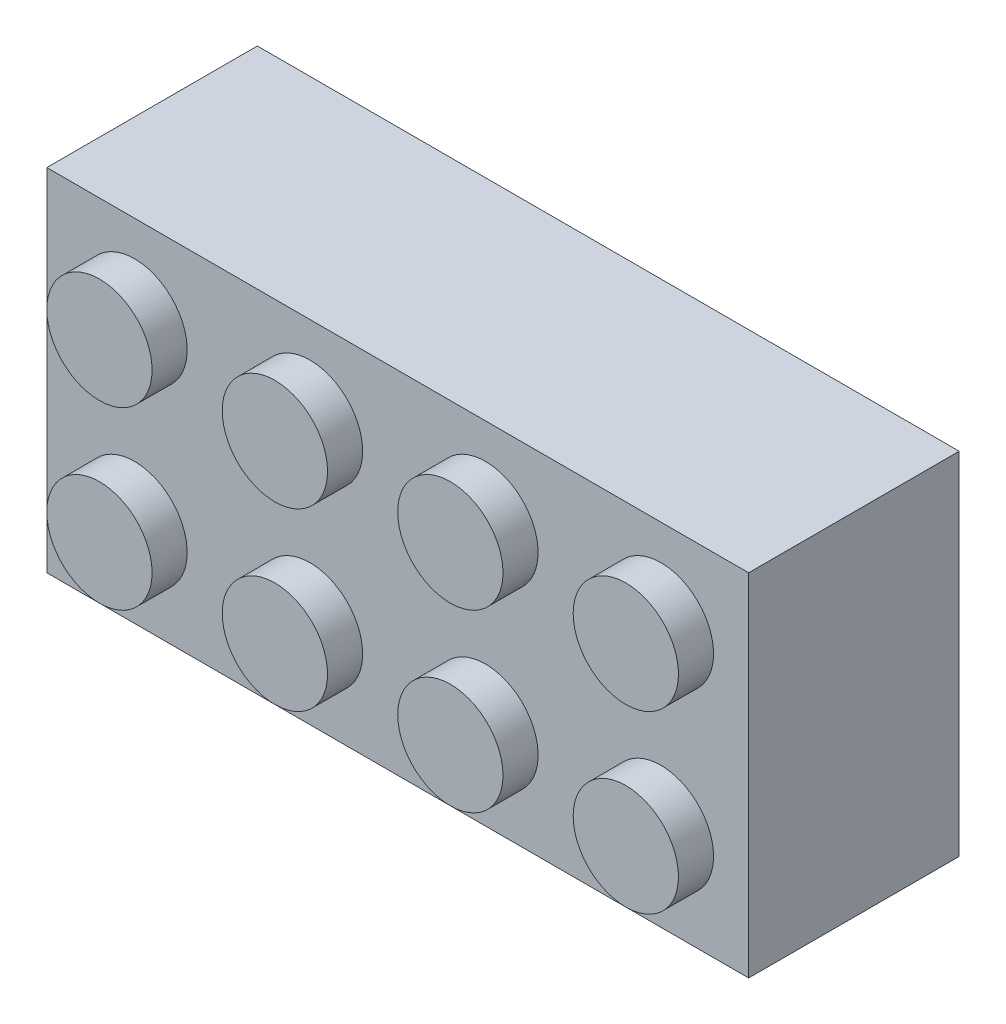
ISO-10303-21;
HEADER;
FILE_DESCRIPTION(('STEP AP214'),'2;1');
FILE_NAME('part.step','',(''),(''),'','','');
FILE_SCHEMA(('AUTOMOTIVE_DESIGN { 1 0 10303 214 1 1 1 1 }'));
ENDSEC;
DATA;
#1=APPLICATION_CONTEXT('core data for automotive mechanical design processes');
#2=APPLICATION_PROTOCOL_DEFINITION('international standard','automotive_design',2000,#1);
#3=PRODUCT_CONTEXT('',#1,'mechanical');
#4=PRODUCT('Part','Part','',(#3));
#5=PRODUCT_RELATED_PRODUCT_CATEGORY('part','',(#4));
#6=PRODUCT_DEFINITION_FORMATION('','',#4);
#7=PRODUCT_DEFINITION_CONTEXT('part definition',#1,'design');
#8=PRODUCT_DEFINITION('design','',#6,#7);
#9=PRODUCT_DEFINITION_SHAPE('','',#8);
#10=(LENGTH_UNIT() NAMED_UNIT(*) SI_UNIT(.MILLI.,.METRE.));
#11=(NAMED_UNIT(*) PLANE_ANGLE_UNIT() SI_UNIT($,.RADIAN.));
#12=(NAMED_UNIT(*) SI_UNIT($,.STERADIAN.) SOLID_ANGLE_UNIT());
#13=UNCERTAINTY_MEASURE_WITH_UNIT(LENGTH_MEASURE(1.E-05),#10,'distance_accuracy_value','');
#14=(GEOMETRIC_REPRESENTATION_CONTEXT(3) GLOBAL_UNCERTAINTY_ASSIGNED_CONTEXT((#13)) GLOBAL_UNIT_ASSIGNED_CONTEXT((#10,
#11,#12)) REPRESENTATION_CONTEXT('',''));
#15=CARTESIAN_POINT('',(0.,0.,0.));
#16=DIRECTION('',(0.,0.,1.));
#17=DIRECTION('',(1.,0.,0.));
#18=AXIS2_PLACEMENT_3D('',#15,#16,#17);
#19=CARTESIAN_POINT('',(23.8125,7.9375,0.));
#20=DIRECTION('',(0.,0.,1.));
#21=DIRECTION('',(1.,0.,0.));
#22=AXIS2_PLACEMENT_3D('',#19,#20,#21);
#23=CYLINDRICAL_SURFACE('',#22,3.175);
#24=CARTESIAN_POINT('',(23.8125,7.9375,0.));
#25=DIRECTION('',(0.,0.,-1.));
#26=DIRECTION('',(-1.,0.,0.));
#27=AXIS2_PLACEMENT_3D('',#24,#25,#26);
#28=CIRCLE('',#27,3.175);
#29=CARTESIAN_POINT('',(20.6375,7.9375,0.));
#30=VERTEX_POINT('',#29);
#31=EDGE_CURVE('E11',#30,#30,#28,.T.);
#32=ORIENTED_EDGE('',*,*,#31,.F.);
#33=EDGE_LOOP('',(#32));
#34=FACE_BOUND('',#33,.T.);
#35=CARTESIAN_POINT('',(23.8125,7.9375,7.9375));
#36=DIRECTION('',(0.,0.,-1.));
#37=DIRECTION('',(-1.,0.,0.));
#38=AXIS2_PLACEMENT_3D('',#35,#36,#37);
#39=CIRCLE('',#38,3.175);
#40=CARTESIAN_POINT('',(20.6375,7.9375,7.9375));
#41=VERTEX_POINT('',#40);
#42=EDGE_CURVE('E43',#41,#41,#39,.T.);
#43=ORIENTED_EDGE('',*,*,#42,.T.);
#44=EDGE_LOOP('',(#43));
#45=FACE_BOUND('',#44,.T.);
#46=ADVANCED_FACE('F40',(#34,#45),#23,.T.);
#47=CARTESIAN_POINT('',(23.8125,7.9375,0.));
#48=DIRECTION('',(0.,0.,-1.));
#49=DIRECTION('',(-1.,0.,0.));
#50=AXIS2_PLACEMENT_3D('',#47,#48,#49);
#51=PLANE('',#50);
#52=CARTESIAN_POINT('',(23.8125,7.9375,0.));
#53=DIRECTION('',(0.,0.,-1.));
#54=DIRECTION('',(-1.,0.,0.));
#55=AXIS2_PLACEMENT_3D('',#52,#53,#54);
#56=CIRCLE('',#55,2.38125);
#57=CARTESIAN_POINT('',(21.43125,7.9375,0.));
#58=VERTEX_POINT('',#57);
#59=EDGE_CURVE('E50',#58,#58,#56,.T.);
#60=ORIENTED_EDGE('',*,*,#59,.F.);
#61=EDGE_LOOP('',(#60));
#62=FACE_BOUND('',#61,.T.);
#63=ORIENTED_EDGE('',*,*,#31,.T.);
#64=EDGE_LOOP('',(#63));
#65=FACE_BOUND('',#64,.T.);
#66=ADVANCED_FACE('F70',(#62,#65),#51,.T.);
#67=CARTESIAN_POINT('',(23.8125,7.9375,7.9375));
#68=DIRECTION('',(0.,0.,-1.));
#69=DIRECTION('',(-1.,0.,0.));
#70=AXIS2_PLACEMENT_3D('',#67,#68,#69);
#71=PLANE('',#70);
#72=ORIENTED_EDGE('',*,*,#42,.F.);
#73=EDGE_LOOP('',(#72));
#74=FACE_BOUND('',#73,.T.);
#75=ADVANCED_FACE('F62',(#74),#71,.F.);
#76=CARTESIAN_POINT('',(23.8125,7.9375,0.));
#77=DIRECTION('',(0.,0.,1.));
#78=DIRECTION('',(1.,0.,0.));
#79=AXIS2_PLACEMENT_3D('',#76,#77,#78);
#80=CYLINDRICAL_SURFACE('',#79,2.38125);
#81=ORIENTED_EDGE('',*,*,#59,.T.);
#82=EDGE_LOOP('',(#81));
#83=FACE_BOUND('',#82,.T.);
#84=CARTESIAN_POINT('',(23.8125,7.9375,7.14375));
#85=DIRECTION('',(0.,0.,-1.));
#86=DIRECTION('',(-1.,0.,0.));
#87=AXIS2_PLACEMENT_3D('',#84,#85,#86);
#88=CIRCLE('',#87,2.38125);
#89=CARTESIAN_POINT('',(21.43125,7.9375,7.14375));
#90=VERTEX_POINT('',#89);
#91=EDGE_CURVE('E54',#90,#90,#88,.T.);
#92=ORIENTED_EDGE('',*,*,#91,.F.);
#93=EDGE_LOOP('',(#92));
#94=FACE_BOUND('',#93,.T.);
#95=ADVANCED_FACE('F60',(#83,#94),#80,.F.);
#96=CARTESIAN_POINT('',(23.8125,7.9375,7.14375));
#97=DIRECTION('',(0.,0.,-1.));
#98=DIRECTION('',(-1.,0.,0.));
#99=AXIS2_PLACEMENT_3D('',#96,#97,#98);
#100=PLANE('',#99);
#101=ORIENTED_EDGE('',*,*,#91,.T.);
#102=EDGE_LOOP('',(#101));
#103=FACE_BOUND('',#102,.T.);
#104=ADVANCED_FACE('F58',(#103),#100,.T.);
#105=CLOSED_SHELL('',(#46,#66,#75,#95,#104));
#106=MANIFOLD_SOLID_BREP('B2',#105);
#107=CARTESIAN_POINT('',(0.,0.,7.9375));
#108=DIRECTION('',(0.,0.,-1.));
#109=DIRECTION('',(-1.,0.,0.));
#110=AXIS2_PLACEMENT_3D('',#107,#108,#109);
#111=PLANE('',#110);
#112=CARTESIAN_POINT('',(15.875,7.9375,7.9375));
#113=DIRECTION('',(0.,0.,-1.));
#114=DIRECTION('',(-1.,0.,0.));
#115=AXIS2_PLACEMENT_3D('',#112,#113,#114);
#116=CIRCLE('',#115,3.175);
#117=CARTESIAN_POINT('',(12.7,7.9375,7.9375));
#118=VERTEX_POINT('',#117);
#119=EDGE_CURVE('E826',#118,#118,#116,.T.);
#120=ORIENTED_EDGE('',*,*,#119,.F.);
#121=EDGE_LOOP('',(#120));
#122=FACE_BOUND('',#121,.T.);
#123=CARTESIAN_POINT('',(3.96875,11.90625,7.9375));
#124=DIRECTION('',(0.,0.,-1.));
#125=DIRECTION('',(-1.,0.,0.));
#126=AXIS2_PLACEMENT_3D('',#123,#124,#125);
#127=CIRCLE('',#126,0.79375);
#128=CARTESIAN_POINT('',(3.175,11.90625,7.9375));
#129=VERTEX_POINT('',#128);
#130=EDGE_CURVE('E214',#129,#129,#127,.F.);
#131=ORIENTED_EDGE('',*,*,#130,.T.);
#132=EDGE_LOOP('',(#131));
#133=FACE_BOUND('',#132,.T.);
#134=DIRECTION('',(0.,-1.,0.));
#135=VECTOR('',#134,1.);
#136=CARTESIAN_POINT('',(1.5875,0.,7.9375));
#137=LINE('',#136,#135);
#138=CARTESIAN_POINT('',(1.5875,14.2875,7.9375));
#139=VERTEX_POINT('',#138);
#140=CARTESIAN_POINT('',(1.5875,1.5875,7.9375));
#141=VERTEX_POINT('',#140);
#142=EDGE_CURVE('E196',#139,#141,#137,.T.);
#143=ORIENTED_EDGE('',*,*,#142,.F.);
#144=DIRECTION('',(-1.,0.,0.));
#145=VECTOR('',#144,1.);
#146=CARTESIAN_POINT('',(0.,14.2875,7.9375));
#147=LINE('',#146,#145);
#148=CARTESIAN_POINT('',(30.1625,14.2875,7.9375));
#149=VERTEX_POINT('',#148);
#150=EDGE_CURVE('E204',#149,#139,#147,.T.);
#151=ORIENTED_EDGE('',*,*,#150,.F.);
#152=DIRECTION('',(0.,1.,0.));
#153=VECTOR('',#152,1.);
#154=CARTESIAN_POINT('',(30.1625,0.,7.9375));
#155=LINE('',#154,#153);
#156=CARTESIAN_POINT('',(30.1625,1.5875,7.9375));
#157=VERTEX_POINT('',#156);
#158=EDGE_CURVE('E195',#157,#149,#155,.T.);
#159=ORIENTED_EDGE('',*,*,#158,.F.);
#160=DIRECTION('',(1.,0.,0.));
#161=VECTOR('',#160,1.);
#162=CARTESIAN_POINT('',(0.,1.5875,7.9375));
#163=LINE('',#162,#161);
#164=EDGE_CURVE('E185',#141,#157,#163,.T.);
#165=ORIENTED_EDGE('',*,*,#164,.F.);
#166=EDGE_LOOP('',(#143,#151,#159,#165));
#167=FACE_BOUND('',#166,.T.);
#168=CARTESIAN_POINT('',(3.96875,3.96875,7.9375));
#169=DIRECTION('',(0.,0.,-1.));
#170=DIRECTION('',(-1.,0.,0.));
#171=AXIS2_PLACEMENT_3D('',#168,#169,#170);
#172=CIRCLE('',#171,0.79375);
#173=CARTESIAN_POINT('',(3.175,3.96875,7.9375));
#174=VERTEX_POINT('',#173);
#175=EDGE_CURVE('E210',#174,#174,#172,.F.);
#176=ORIENTED_EDGE('',*,*,#175,.T.);
#177=EDGE_LOOP('',(#176));
#178=FACE_BOUND('',#177,.T.);
#179=CARTESIAN_POINT('',(11.90625,11.90625,7.9375));
#180=DIRECTION('',(0.,0.,-1.));
#181=DIRECTION('',(-1.,0.,0.));
#182=AXIS2_PLACEMENT_3D('',#179,#180,#181);
#183=CIRCLE('',#182,0.79375);
#184=CARTESIAN_POINT('',(11.1125,11.90625,7.9375));
#185=VERTEX_POINT('',#184);
#186=EDGE_CURVE('E213',#185,#185,#183,.F.);
#187=ORIENTED_EDGE('',*,*,#186,.T.);
#188=EDGE_LOOP('',(#187));
#189=FACE_BOUND('',#188,.T.);
#190=CARTESIAN_POINT('',(11.90625,3.96875,7.9375));
#191=DIRECTION('',(0.,0.,-1.));
#192=DIRECTION('',(-1.,0.,0.));
#193=AXIS2_PLACEMENT_3D('',#190,#191,#192);
#194=CIRCLE('',#193,0.79375);
#195=CARTESIAN_POINT('',(11.1125,3.96875,7.9375));
#196=VERTEX_POINT('',#195);
#197=EDGE_CURVE('E218',#196,#196,#194,.F.);
#198=ORIENTED_EDGE('',*,*,#197,.T.);
#199=EDGE_LOOP('',(#198));
#200=FACE_BOUND('',#199,.T.);
#201=CARTESIAN_POINT('',(19.84375,11.90625,7.9375));
#202=DIRECTION('',(0.,0.,-1.));
#203=DIRECTION('',(-1.,0.,0.));
#204=AXIS2_PLACEMENT_3D('',#201,#202,#203);
#205=CIRCLE('',#204,0.79375);
#206=CARTESIAN_POINT('',(19.05,11.90625,7.9375));
#207=VERTEX_POINT('',#206);
#208=EDGE_CURVE('E222',#207,#207,#205,.F.);
#209=ORIENTED_EDGE('',*,*,#208,.T.);
#210=EDGE_LOOP('',(#209));
#211=FACE_BOUND('',#210,.T.);
#212=CARTESIAN_POINT('',(19.84375,3.96875,7.9375));
#213=DIRECTION('',(0.,0.,-1.));
#214=DIRECTION('',(-1.,0.,0.));
#215=AXIS2_PLACEMENT_3D('',#212,#213,#214);
#216=CIRCLE('',#215,0.79375);
#217=CARTESIAN_POINT('',(19.05,3.96875,7.9375));
#218=VERTEX_POINT('',#217);
#219=EDGE_CURVE('E226',#218,#218,#216,.F.);
#220=ORIENTED_EDGE('',*,*,#219,.T.);
#221=EDGE_LOOP('',(#220));
#222=FACE_BOUND('',#221,.T.);
#223=CARTESIAN_POINT('',(27.78125,11.90625,7.9375));
#224=DIRECTION('',(0.,0.,-1.));
#225=DIRECTION('',(-1.,0.,0.));
#226=AXIS2_PLACEMENT_3D('',#223,#224,#225);
#227=CIRCLE('',#226,0.79375);
#228=CARTESIAN_POINT('',(26.9875,11.90625,7.9375));
#229=VERTEX_POINT('',#228);
#230=EDGE_CURVE('E230',#229,#229,#227,.F.);
#231=ORIENTED_EDGE('',*,*,#230,.T.);
#232=EDGE_LOOP('',(#231));
#233=FACE_BOUND('',#232,.T.);
#234=CARTESIAN_POINT('',(27.78125,3.96875,7.9375));
#235=DIRECTION('',(0.,0.,-1.));
#236=DIRECTION('',(-1.,0.,0.));
#237=AXIS2_PLACEMENT_3D('',#234,#235,#236);
#238=CIRCLE('',#237,0.79375);
#239=CARTESIAN_POINT('',(26.9875,3.96875,7.9375));
#240=VERTEX_POINT('',#239);
#241=EDGE_CURVE('E234',#240,#240,#238,.F.);
#242=ORIENTED_EDGE('',*,*,#241,.T.);
#243=EDGE_LOOP('',(#242));
#244=FACE_BOUND('',#243,.T.);
#245=CARTESIAN_POINT('',(7.9375,7.9375,7.9375));
#246=DIRECTION('',(0.,0.,-1.));
#247=DIRECTION('',(-1.,0.,0.));
#248=AXIS2_PLACEMENT_3D('',#245,#246,#247);
#249=CIRCLE('',#248,3.175);
#250=CARTESIAN_POINT('',(4.7625,7.9375,7.9375));
#251=VERTEX_POINT('',#250);
#252=EDGE_CURVE('E829',#251,#251,#249,.T.);
#253=ORIENTED_EDGE('',*,*,#252,.F.);
#254=EDGE_LOOP('',(#253));
#255=FACE_BOUND('',#254,.T.);
#256=ADVANCED_FACE('F110',(#122,#133,#167,#178,#189,#200,#211,#222,#233,#244,#255),#111,.T.);
#257=CARTESIAN_POINT('',(0.,0.,0.));
#258=DIRECTION('',(0.,0.,-1.));
#259=DIRECTION('',(-1.,0.,0.));
#260=AXIS2_PLACEMENT_3D('',#257,#258,#259);
#261=PLANE('',#260);
#262=DIRECTION('',(0.,-1.,0.));
#263=VECTOR('',#262,1.);
#264=CARTESIAN_POINT('',(0.,0.,0.));
#265=LINE('',#264,#263);
#266=CARTESIAN_POINT('',(0.,15.875,0.));
#267=VERTEX_POINT('',#266);
#268=CARTESIAN_POINT('',(0.,0.,0.));
#269=VERTEX_POINT('',#268);
#270=EDGE_CURVE('E275',#267,#269,#265,.T.);
#271=ORIENTED_EDGE('',*,*,#270,.F.);
#272=DIRECTION('',(-1.,0.,0.));
#273=VECTOR('',#272,1.);
#274=CARTESIAN_POINT('',(0.,15.875,0.));
#275=LINE('',#274,#273);
#276=CARTESIAN_POINT('',(31.75,15.875,0.));
#277=VERTEX_POINT('',#276);
#278=EDGE_CURVE('E155',#277,#267,#275,.T.);
#279=ORIENTED_EDGE('',*,*,#278,.F.);
#280=DIRECTION('',(0.,1.,0.));
#281=VECTOR('',#280,1.);
#282=CARTESIAN_POINT('',(31.75,0.,0.));
#283=LINE('',#282,#281);
#284=CARTESIAN_POINT('',(31.75,0.,0.));
#285=VERTEX_POINT('',#284);
#286=EDGE_CURVE('E287',#285,#277,#283,.T.);
#287=ORIENTED_EDGE('',*,*,#286,.F.);
#288=DIRECTION('',(1.,0.,0.));
#289=VECTOR('',#288,1.);
#290=CARTESIAN_POINT('',(0.,0.,0.));
#291=LINE('',#290,#289);
#292=EDGE_CURVE('E285',#269,#285,#291,.T.);
#293=ORIENTED_EDGE('',*,*,#292,.F.);
#294=EDGE_LOOP('',(#271,#279,#287,#293));
#295=FACE_BOUND('',#294,.T.);
#296=DIRECTION('',(-1.,0.,0.));
#297=VECTOR('',#296,1.);
#298=CARTESIAN_POINT('',(0.,14.2875,0.));
#299=LINE('',#298,#297);
#300=CARTESIAN_POINT('',(30.1625,14.2875,0.));
#301=VERTEX_POINT('',#300);
#302=CARTESIAN_POINT('',(1.5875,14.2875,0.));
#303=VERTEX_POINT('',#302);
#304=EDGE_CURVE('E265',#301,#303,#299,.T.);
#305=ORIENTED_EDGE('',*,*,#304,.T.);
#306=DIRECTION('',(0.,-1.,0.));
#307=VECTOR('',#306,1.);
#308=CARTESIAN_POINT('',(1.5875,0.,0.));
#309=LINE('',#308,#307);
#310=CARTESIAN_POINT('',(1.5875,1.5875,0.));
#311=VERTEX_POINT('',#310);
#312=EDGE_CURVE('E244',#303,#311,#309,.T.);
#313=ORIENTED_EDGE('',*,*,#312,.T.);
#314=DIRECTION('',(1.,0.,0.));
#315=VECTOR('',#314,1.);
#316=CARTESIAN_POINT('',(0.,1.5875,0.));
#317=LINE('',#316,#315);
#318=CARTESIAN_POINT('',(30.1625,1.5875,0.));
#319=VERTEX_POINT('',#318);
#320=EDGE_CURVE('E264',#311,#319,#317,.T.);
#321=ORIENTED_EDGE('',*,*,#320,.T.);
#322=DIRECTION('',(0.,1.,0.));
#323=VECTOR('',#322,1.);
#324=CARTESIAN_POINT('',(30.1625,0.,0.));
#325=LINE('',#324,#323);
#326=EDGE_CURVE('E125',#319,#301,#325,.T.);
#327=ORIENTED_EDGE('',*,*,#326,.T.);
#328=EDGE_LOOP('',(#305,#313,#321,#327));
#329=FACE_BOUND('',#328,.T.);
#330=ADVANCED_FACE('F341',(#295,#329),#261,.T.);
#331=CARTESIAN_POINT('',(0.,0.,9.525));
#332=DIRECTION('',(0.,0.,-1.));
#333=DIRECTION('',(-1.,0.,0.));
#334=AXIS2_PLACEMENT_3D('',#331,#332,#333);
#335=PLANE('',#334);
#336=CARTESIAN_POINT('',(3.96875,11.90625,9.525));
#337=DIRECTION('',(0.,0.,-1.));
#338=DIRECTION('',(-1.,0.,0.));
#339=AXIS2_PLACEMENT_3D('',#336,#337,#338);
#340=CIRCLE('',#339,2.38125);
#341=CARTESIAN_POINT('',(1.5875,11.90625,9.525));
#342=VERTEX_POINT('',#341);
#343=EDGE_CURVE('E298',#342,#342,#340,.F.);
#344=ORIENTED_EDGE('',*,*,#343,.F.);
#345=EDGE_LOOP('',(#344));
#346=FACE_BOUND('',#345,.T.);
#347=DIRECTION('',(0.,-1.,0.));
#348=VECTOR('',#347,1.);
#349=CARTESIAN_POINT('',(0.,0.,9.525));
#350=LINE('',#349,#348);
#351=CARTESIAN_POINT('',(0.,15.875,9.525));
#352=VERTEX_POINT('',#351);
#353=CARTESIAN_POINT('',(0.,0.,9.525));
#354=VERTEX_POINT('',#353);
#355=EDGE_CURVE('E276',#352,#354,#350,.T.);
#356=ORIENTED_EDGE('',*,*,#355,.T.);
#357=DIRECTION('',(1.,0.,0.));
#358=VECTOR('',#357,1.);
#359=CARTESIAN_POINT('',(0.,0.,9.525));
#360=LINE('',#359,#358);
#361=CARTESIAN_POINT('',(31.75,0.,9.525));
#362=VERTEX_POINT('',#361);
#363=EDGE_CURVE('E163',#354,#362,#360,.T.);
#364=ORIENTED_EDGE('',*,*,#363,.T.);
#365=DIRECTION('',(0.,1.,0.));
#366=VECTOR('',#365,1.);
#367=CARTESIAN_POINT('',(31.75,0.,9.525));
#368=LINE('',#367,#366);
#369=CARTESIAN_POINT('',(31.75,15.875,9.525));
#370=VERTEX_POINT('',#369);
#371=EDGE_CURVE('E279',#362,#370,#368,.T.);
#372=ORIENTED_EDGE('',*,*,#371,.T.);
#373=DIRECTION('',(-1.,0.,0.));
#374=VECTOR('',#373,1.);
#375=CARTESIAN_POINT('',(0.,15.875,9.525));
#376=LINE('',#375,#374);
#377=EDGE_CURVE('E134',#370,#352,#376,.T.);
#378=ORIENTED_EDGE('',*,*,#377,.T.);
#379=EDGE_LOOP('',(#356,#364,#372,#378));
#380=FACE_BOUND('',#379,.T.);
#381=CARTESIAN_POINT('',(3.96875,3.96875,9.525));
#382=DIRECTION('',(0.,0.,-1.));
#383=DIRECTION('',(-1.,0.,0.));
#384=AXIS2_PLACEMENT_3D('',#381,#382,#383);
#385=CIRCLE('',#384,2.38125);
#386=CARTESIAN_POINT('',(1.5875,3.96875,9.525));
#387=VERTEX_POINT('',#386);
#388=EDGE_CURVE('E301',#387,#387,#385,.F.);
#389=ORIENTED_EDGE('',*,*,#388,.F.);
#390=EDGE_LOOP('',(#389));
#391=FACE_BOUND('',#390,.T.);
#392=CARTESIAN_POINT('',(11.90625,11.90625,9.525));
#393=DIRECTION('',(0.,0.,-1.));
#394=DIRECTION('',(-1.,0.,0.));
#395=AXIS2_PLACEMENT_3D('',#392,#393,#394);
#396=CIRCLE('',#395,2.38125);
#397=CARTESIAN_POINT('',(9.525,11.90625,9.525));
#398=VERTEX_POINT('',#397);
#399=EDGE_CURVE('E304',#398,#398,#396,.F.);
#400=ORIENTED_EDGE('',*,*,#399,.F.);
#401=EDGE_LOOP('',(#400));
#402=FACE_BOUND('',#401,.T.);
#403=CARTESIAN_POINT('',(11.90625,3.96875,9.525));
#404=DIRECTION('',(0.,0.,-1.));
#405=DIRECTION('',(-1.,0.,0.));
#406=AXIS2_PLACEMENT_3D('',#403,#404,#405);
#407=CIRCLE('',#406,2.38125);
#408=CARTESIAN_POINT('',(9.525,3.96875,9.525));
#409=VERTEX_POINT('',#408);
#410=EDGE_CURVE('E310',#409,#409,#407,.F.);
#411=ORIENTED_EDGE('',*,*,#410,.F.);
#412=EDGE_LOOP('',(#411));
#413=FACE_BOUND('',#412,.T.);
#414=CARTESIAN_POINT('',(19.84375,11.90625,9.525));
#415=DIRECTION('',(0.,0.,-1.));
#416=DIRECTION('',(-1.,0.,0.));
#417=AXIS2_PLACEMENT_3D('',#414,#415,#416);
#418=CIRCLE('',#417,2.38125);
#419=CARTESIAN_POINT('',(17.4625,11.90625,9.525));
#420=VERTEX_POINT('',#419);
#421=EDGE_CURVE('E316',#420,#420,#418,.F.);
#422=ORIENTED_EDGE('',*,*,#421,.F.);
#423=EDGE_LOOP('',(#422));
#424=FACE_BOUND('',#423,.T.);
#425=CARTESIAN_POINT('',(19.84375,3.96875,9.525));
#426=DIRECTION('',(0.,0.,-1.));
#427=DIRECTION('',(-1.,0.,0.));
#428=AXIS2_PLACEMENT_3D('',#425,#426,#427);
#429=CIRCLE('',#428,2.38125);
#430=CARTESIAN_POINT('',(17.4625,3.96875,9.525));
#431=VERTEX_POINT('',#430);
#432=EDGE_CURVE('E322',#431,#431,#429,.F.);
#433=ORIENTED_EDGE('',*,*,#432,.F.);
#434=EDGE_LOOP('',(#433));
#435=FACE_BOUND('',#434,.T.);
#436=CARTESIAN_POINT('',(27.78125,11.90625,9.525));
#437=DIRECTION('',(0.,0.,-1.));
#438=DIRECTION('',(-1.,0.,0.));
#439=AXIS2_PLACEMENT_3D('',#436,#437,#438);
#440=CIRCLE('',#439,2.38125);
#441=CARTESIAN_POINT('',(25.4,11.90625,9.525));
#442=VERTEX_POINT('',#441);
#443=EDGE_CURVE('E328',#442,#442,#440,.F.);
#444=ORIENTED_EDGE('',*,*,#443,.F.);
#445=EDGE_LOOP('',(#444));
#446=FACE_BOUND('',#445,.T.);
#447=CARTESIAN_POINT('',(27.78125,3.96875,9.525));
#448=DIRECTION('',(0.,0.,-1.));
#449=DIRECTION('',(-1.,0.,0.));
#450=AXIS2_PLACEMENT_3D('',#447,#448,#449);
#451=CIRCLE('',#450,2.38125);
#452=CARTESIAN_POINT('',(25.4,3.96875,9.525));
#453=VERTEX_POINT('',#452);
#454=EDGE_CURVE('E118',#453,#453,#451,.F.);
#455=ORIENTED_EDGE('',*,*,#454,.F.);
#456=EDGE_LOOP('',(#455));
#457=FACE_BOUND('',#456,.T.);
#458=ADVANCED_FACE('F338',(#346,#380,#391,#402,#413,#424,#435,#446,#457),#335,.F.);
#459=CARTESIAN_POINT('',(0.,0.,9.525));
#460=DIRECTION('',(1.,0.,0.));
#461=DIRECTION('',(0.,0.,-1.));
#462=AXIS2_PLACEMENT_3D('',#459,#460,#461);
#463=PLANE('',#462);
#464=ORIENTED_EDGE('',*,*,#270,.T.);
#465=DIRECTION('',(0.,0.,-1.));
#466=VECTOR('',#465,1.);
#467=CARTESIAN_POINT('',(0.,0.,9.525));
#468=LINE('',#467,#466);
#469=EDGE_CURVE('E296',#354,#269,#468,.T.);
#470=ORIENTED_EDGE('',*,*,#469,.F.);
#471=ORIENTED_EDGE('',*,*,#355,.F.);
#472=DIRECTION('',(0.,0.,-1.));
#473=VECTOR('',#472,1.);
#474=CARTESIAN_POINT('',(0.,15.875,9.525));
#475=LINE('',#474,#473);
#476=EDGE_CURVE('E282',#352,#267,#475,.T.);
#477=ORIENTED_EDGE('',*,*,#476,.T.);
#478=EDGE_LOOP('',(#464,#470,#471,#477));
#479=FACE_BOUND('',#478,.T.);
#480=ADVANCED_FACE('F340',(#479),#463,.F.);
#481=CARTESIAN_POINT('',(0.,0.,9.525));
#482=DIRECTION('',(0.,1.,0.));
#483=DIRECTION('',(0.,0.,1.));
#484=AXIS2_PLACEMENT_3D('',#481,#482,#483);
#485=PLANE('',#484);
#486=ORIENTED_EDGE('',*,*,#292,.T.);
#487=DIRECTION('',(0.,0.,-1.));
#488=VECTOR('',#487,1.);
#489=CARTESIAN_POINT('',(31.75,0.,9.525));
#490=LINE('',#489,#488);
#491=EDGE_CURVE('E293',#362,#285,#490,.T.);
#492=ORIENTED_EDGE('',*,*,#491,.F.);
#493=ORIENTED_EDGE('',*,*,#363,.F.);
#494=ORIENTED_EDGE('',*,*,#469,.T.);
#495=EDGE_LOOP('',(#486,#492,#493,#494));
#496=FACE_BOUND('',#495,.T.);
#497=ADVANCED_FACE('F348',(#496),#485,.F.);
#498=CARTESIAN_POINT('',(31.75,0.,9.525));
#499=DIRECTION('',(-1.,0.,0.));
#500=DIRECTION('',(0.,0.,1.));
#501=AXIS2_PLACEMENT_3D('',#498,#499,#500);
#502=PLANE('',#501);
#503=ORIENTED_EDGE('',*,*,#286,.T.);
#504=DIRECTION('',(0.,0.,-1.));
#505=VECTOR('',#504,1.);
#506=CARTESIAN_POINT('',(31.75,15.875,9.525));
#507=LINE('',#506,#505);
#508=EDGE_CURVE('E291',#370,#277,#507,.T.);
#509=ORIENTED_EDGE('',*,*,#508,.F.);
#510=ORIENTED_EDGE('',*,*,#371,.F.);
#511=ORIENTED_EDGE('',*,*,#491,.T.);
#512=EDGE_LOOP('',(#503,#509,#510,#511));
#513=FACE_BOUND('',#512,.T.);
#514=ADVANCED_FACE('F462',(#513),#502,.F.);
#515=CARTESIAN_POINT('',(0.,15.875,9.525));
#516=DIRECTION('',(0.,-1.,0.));
#517=DIRECTION('',(0.,0.,-1.));
#518=AXIS2_PLACEMENT_3D('',#515,#516,#517);
#519=PLANE('',#518);
#520=ORIENTED_EDGE('',*,*,#278,.T.);
#521=ORIENTED_EDGE('',*,*,#476,.F.);
#522=ORIENTED_EDGE('',*,*,#377,.F.);
#523=ORIENTED_EDGE('',*,*,#508,.T.);
#524=EDGE_LOOP('',(#520,#521,#522,#523));
#525=FACE_BOUND('',#524,.T.);
#526=ADVANCED_FACE('F457',(#525),#519,.F.);
#527=CARTESIAN_POINT('',(3.96875,11.90625,11.1125));
#528=DIRECTION('',(0.,0.,-1.));
#529=DIRECTION('',(-1.,0.,0.));
#530=AXIS2_PLACEMENT_3D('',#527,#528,#529);
#531=CYLINDRICAL_SURFACE('',#530,2.38125);
#532=CARTESIAN_POINT('',(3.96875,11.90625,11.1125));
#533=DIRECTION('',(0.,0.,1.));
#534=DIRECTION('',(1.,0.,0.));
#535=AXIS2_PLACEMENT_3D('',#532,#533,#534);
#536=CIRCLE('',#535,2.38125);
#537=CARTESIAN_POINT('',(6.35,11.90625,11.1125));
#538=VERTEX_POINT('',#537);
#539=EDGE_CURVE('E272',#538,#538,#536,.T.);
#540=ORIENTED_EDGE('',*,*,#539,.F.);
#541=EDGE_LOOP('',(#540));
#542=FACE_BOUND('',#541,.T.);
#543=ORIENTED_EDGE('',*,*,#343,.T.);
#544=EDGE_LOOP('',(#543));
#545=FACE_BOUND('',#544,.T.);
#546=ADVANCED_FACE('F454',(#542,#545),#531,.T.);
#547=CARTESIAN_POINT('',(3.96875,11.90625,11.1125));
#548=DIRECTION('',(0.,0.,1.));
#549=DIRECTION('',(1.,0.,0.));
#550=AXIS2_PLACEMENT_3D('',#547,#548,#549);
#551=PLANE('',#550);
#552=ORIENTED_EDGE('',*,*,#539,.T.);
#553=EDGE_LOOP('',(#552));
#554=FACE_BOUND('',#553,.T.);
#555=ADVANCED_FACE('F451',(#554),#551,.T.);
#556=CARTESIAN_POINT('',(3.96875,3.96875,11.1125));
#557=DIRECTION('',(0.,0.,-1.));
#558=DIRECTION('',(-1.,0.,0.));
#559=AXIS2_PLACEMENT_3D('',#556,#557,#558);
#560=CYLINDRICAL_SURFACE('',#559,2.38125);
#561=CARTESIAN_POINT('',(3.96875,3.96875,11.1125));
#562=DIRECTION('',(0.,0.,1.));
#563=DIRECTION('',(1.,0.,0.));
#564=AXIS2_PLACEMENT_3D('',#561,#562,#563);
#565=CIRCLE('',#564,2.38125);
#566=CARTESIAN_POINT('',(6.35,3.96875,11.1125));
#567=VERTEX_POINT('',#566);
#568=EDGE_CURVE('E261',#567,#567,#565,.T.);
#569=ORIENTED_EDGE('',*,*,#568,.F.);
#570=EDGE_LOOP('',(#569));
#571=FACE_BOUND('',#570,.T.);
#572=ORIENTED_EDGE('',*,*,#388,.T.);
#573=EDGE_LOOP('',(#572));
#574=FACE_BOUND('',#573,.T.);
#575=ADVANCED_FACE('F447',(#571,#574),#560,.T.);
#576=CARTESIAN_POINT('',(3.96875,3.96875,11.1125));
#577=DIRECTION('',(0.,0.,1.));
#578=DIRECTION('',(1.,0.,0.));
#579=AXIS2_PLACEMENT_3D('',#576,#577,#578);
#580=PLANE('',#579);
#581=ORIENTED_EDGE('',*,*,#568,.T.);
#582=EDGE_LOOP('',(#581));
#583=FACE_BOUND('',#582,.T.);
#584=ADVANCED_FACE('F443',(#583),#580,.T.);
#585=CARTESIAN_POINT('',(11.90625,11.90625,11.1125));
#586=DIRECTION('',(0.,0.,1.));
#587=DIRECTION('',(1.,0.,0.));
#588=AXIS2_PLACEMENT_3D('',#585,#586,#587);
#589=PLANE('',#588);
#590=CARTESIAN_POINT('',(11.90625,11.90625,11.1125));
#591=DIRECTION('',(0.,0.,1.));
#592=DIRECTION('',(1.,0.,0.));
#593=AXIS2_PLACEMENT_3D('',#590,#591,#592);
#594=CIRCLE('',#593,2.38125);
#595=CARTESIAN_POINT('',(14.2875,11.90625,11.1125));
#596=VERTEX_POINT('',#595);
#597=EDGE_CURVE('E307',#596,#596,#594,.T.);
#598=ORIENTED_EDGE('',*,*,#597,.T.);
#599=EDGE_LOOP('',(#598));
#600=FACE_BOUND('',#599,.T.);
#601=ADVANCED_FACE('F446',(#600),#589,.T.);
#602=CARTESIAN_POINT('',(11.90625,11.90625,11.1125));
#603=DIRECTION('',(0.,0.,-1.));
#604=DIRECTION('',(-1.,0.,0.));
#605=AXIS2_PLACEMENT_3D('',#602,#603,#604);
#606=CYLINDRICAL_SURFACE('',#605,2.38125);
#607=ORIENTED_EDGE('',*,*,#597,.F.);
#608=EDGE_LOOP('',(#607));
#609=FACE_BOUND('',#608,.T.);
#610=ORIENTED_EDGE('',*,*,#399,.T.);
#611=EDGE_LOOP('',(#610));
#612=FACE_BOUND('',#611,.T.);
#613=ADVANCED_FACE('F474',(#609,#612),#606,.T.);
#614=CARTESIAN_POINT('',(11.90625,3.96875,11.1125));
#615=DIRECTION('',(0.,0.,1.));
#616=DIRECTION('',(1.,0.,0.));
#617=AXIS2_PLACEMENT_3D('',#614,#615,#616);
#618=PLANE('',#617);
#619=CARTESIAN_POINT('',(11.90625,3.96875,11.1125));
#620=DIRECTION('',(0.,0.,1.));
#621=DIRECTION('',(1.,0.,0.));
#622=AXIS2_PLACEMENT_3D('',#619,#620,#621);
#623=CIRCLE('',#622,2.38125);
#624=CARTESIAN_POINT('',(14.2875,3.96875,11.1125));
#625=VERTEX_POINT('',#624);
#626=EDGE_CURVE('E313',#625,#625,#623,.T.);
#627=ORIENTED_EDGE('',*,*,#626,.T.);
#628=EDGE_LOOP('',(#627));
#629=FACE_BOUND('',#628,.T.);
#630=ADVANCED_FACE('F477',(#629),#618,.T.);
#631=CARTESIAN_POINT('',(11.90625,3.96875,11.1125));
#632=DIRECTION('',(0.,0.,-1.));
#633=DIRECTION('',(-1.,0.,0.));
#634=AXIS2_PLACEMENT_3D('',#631,#632,#633);
#635=CYLINDRICAL_SURFACE('',#634,2.38125);
#636=ORIENTED_EDGE('',*,*,#626,.F.);
#637=EDGE_LOOP('',(#636));
#638=FACE_BOUND('',#637,.T.);
#639=ORIENTED_EDGE('',*,*,#410,.T.);
#640=EDGE_LOOP('',(#639));
#641=FACE_BOUND('',#640,.T.);
#642=ADVANCED_FACE('F482',(#638,#641),#635,.T.);
#643=CARTESIAN_POINT('',(19.84375,11.90625,11.1125));
#644=DIRECTION('',(0.,0.,1.));
#645=DIRECTION('',(1.,0.,0.));
#646=AXIS2_PLACEMENT_3D('',#643,#644,#645);
#647=PLANE('',#646);
#648=CARTESIAN_POINT('',(19.84375,11.90625,11.1125));
#649=DIRECTION('',(0.,0.,1.));
#650=DIRECTION('',(1.,0.,0.));
#651=AXIS2_PLACEMENT_3D('',#648,#649,#650);
#652=CIRCLE('',#651,2.38125);
#653=CARTESIAN_POINT('',(22.225,11.90625,11.1125));
#654=VERTEX_POINT('',#653);
#655=EDGE_CURVE('E319',#654,#654,#652,.T.);
#656=ORIENTED_EDGE('',*,*,#655,.T.);
#657=EDGE_LOOP('',(#656));
#658=FACE_BOUND('',#657,.T.);
#659=ADVANCED_FACE('F485',(#658),#647,.T.);
#660=CARTESIAN_POINT('',(19.84375,11.90625,11.1125));
#661=DIRECTION('',(0.,0.,-1.));
#662=DIRECTION('',(-1.,0.,0.));
#663=AXIS2_PLACEMENT_3D('',#660,#661,#662);
#664=CYLINDRICAL_SURFACE('',#663,2.38125);
#665=ORIENTED_EDGE('',*,*,#655,.F.);
#666=EDGE_LOOP('',(#665));
#667=FACE_BOUND('',#666,.T.);
#668=ORIENTED_EDGE('',*,*,#421,.T.);
#669=EDGE_LOOP('',(#668));
#670=FACE_BOUND('',#669,.T.);
#671=ADVANCED_FACE('F490',(#667,#670),#664,.T.);
#672=CARTESIAN_POINT('',(19.84375,3.96875,11.1125));
#673=DIRECTION('',(0.,0.,1.));
#674=DIRECTION('',(1.,0.,0.));
#675=AXIS2_PLACEMENT_3D('',#672,#673,#674);
#676=PLANE('',#675);
#677=CARTESIAN_POINT('',(19.84375,3.96875,11.1125));
#678=DIRECTION('',(0.,0.,1.));
#679=DIRECTION('',(1.,0.,0.));
#680=AXIS2_PLACEMENT_3D('',#677,#678,#679);
#681=CIRCLE('',#680,2.38125);
#682=CARTESIAN_POINT('',(22.225,3.96875,11.1125));
#683=VERTEX_POINT('',#682);
#684=EDGE_CURVE('E325',#683,#683,#681,.T.);
#685=ORIENTED_EDGE('',*,*,#684,.T.);
#686=EDGE_LOOP('',(#685));
#687=FACE_BOUND('',#686,.T.);
#688=ADVANCED_FACE('F493',(#687),#676,.T.);
#689=CARTESIAN_POINT('',(19.84375,3.96875,11.1125));
#690=DIRECTION('',(0.,0.,-1.));
#691=DIRECTION('',(-1.,0.,0.));
#692=AXIS2_PLACEMENT_3D('',#689,#690,#691);
#693=CYLINDRICAL_SURFACE('',#692,2.38125);
#694=ORIENTED_EDGE('',*,*,#684,.F.);
#695=EDGE_LOOP('',(#694));
#696=FACE_BOUND('',#695,.T.);
#697=ORIENTED_EDGE('',*,*,#432,.T.);
#698=EDGE_LOOP('',(#697));
#699=FACE_BOUND('',#698,.T.);
#700=ADVANCED_FACE('F498',(#696,#699),#693,.T.);
#701=CARTESIAN_POINT('',(27.78125,11.90625,11.1125));
#702=DIRECTION('',(0.,0.,1.));
#703=DIRECTION('',(1.,0.,0.));
#704=AXIS2_PLACEMENT_3D('',#701,#702,#703);
#705=PLANE('',#704);
#706=CARTESIAN_POINT('',(27.78125,11.90625,11.1125));
#707=DIRECTION('',(0.,0.,1.));
#708=DIRECTION('',(1.,0.,0.));
#709=AXIS2_PLACEMENT_3D('',#706,#707,#708);
#710=CIRCLE('',#709,2.38125);
#711=CARTESIAN_POINT('',(30.1625,11.90625,11.1125));
#712=VERTEX_POINT('',#711);
#713=EDGE_CURVE('E331',#712,#712,#710,.T.);
#714=ORIENTED_EDGE('',*,*,#713,.T.);
#715=EDGE_LOOP('',(#714));
#716=FACE_BOUND('',#715,.T.);
#717=ADVANCED_FACE('F501',(#716),#705,.T.);
#718=CARTESIAN_POINT('',(27.78125,11.90625,11.1125));
#719=DIRECTION('',(0.,0.,-1.));
#720=DIRECTION('',(-1.,0.,0.));
#721=AXIS2_PLACEMENT_3D('',#718,#719,#720);
#722=CYLINDRICAL_SURFACE('',#721,2.38125);
#723=ORIENTED_EDGE('',*,*,#713,.F.);
#724=EDGE_LOOP('',(#723));
#725=FACE_BOUND('',#724,.T.);
#726=ORIENTED_EDGE('',*,*,#443,.T.);
#727=EDGE_LOOP('',(#726));
#728=FACE_BOUND('',#727,.T.);
#729=ADVANCED_FACE('F506',(#725,#728),#722,.T.);
#730=CARTESIAN_POINT('',(27.78125,3.96875,11.1125));
#731=DIRECTION('',(0.,0.,1.));
#732=DIRECTION('',(1.,0.,0.));
#733=AXIS2_PLACEMENT_3D('',#730,#731,#732);
#734=PLANE('',#733);
#735=CARTESIAN_POINT('',(27.78125,3.96875,11.1125));
#736=DIRECTION('',(0.,0.,1.));
#737=DIRECTION('',(1.,0.,0.));
#738=AXIS2_PLACEMENT_3D('',#735,#736,#737);
#739=CIRCLE('',#738,2.38125);
#740=CARTESIAN_POINT('',(30.1625,3.96875,11.1125));
#741=VERTEX_POINT('',#740);
#742=EDGE_CURVE('E38',#741,#741,#739,.T.);
#743=ORIENTED_EDGE('',*,*,#742,.T.);
#744=EDGE_LOOP('',(#743));
#745=FACE_BOUND('',#744,.T.);
#746=ADVANCED_FACE('F112',(#745),#734,.T.);
#747=CARTESIAN_POINT('',(27.78125,3.96875,11.1125));
#748=DIRECTION('',(0.,0.,-1.));
#749=DIRECTION('',(-1.,0.,0.));
#750=AXIS2_PLACEMENT_3D('',#747,#748,#749);
#751=CYLINDRICAL_SURFACE('',#750,2.38125);
#752=ORIENTED_EDGE('',*,*,#742,.F.);
#753=EDGE_LOOP('',(#752));
#754=FACE_BOUND('',#753,.T.);
#755=ORIENTED_EDGE('',*,*,#454,.T.);
#756=EDGE_LOOP('',(#755));
#757=FACE_BOUND('',#756,.T.);
#758=ADVANCED_FACE('F336',(#754,#757),#751,.T.);
#759=CARTESIAN_POINT('',(1.5875,0.,9.525));
#760=DIRECTION('',(1.,0.,0.));
#761=DIRECTION('',(0.,0.,-1.));
#762=AXIS2_PLACEMENT_3D('',#759,#760,#761);
#763=PLANE('',#762);
#764=ORIENTED_EDGE('',*,*,#312,.F.);
#765=DIRECTION('',(0.,0.,-1.));
#766=VECTOR('',#765,1.);
#767=CARTESIAN_POINT('',(1.5875,14.2875,9.525));
#768=LINE('',#767,#766);
#769=EDGE_CURVE('E206',#139,#303,#768,.T.);
#770=ORIENTED_EDGE('',*,*,#769,.F.);
#771=ORIENTED_EDGE('',*,*,#142,.T.);
#772=DIRECTION('',(0.,0.,-1.));
#773=VECTOR('',#772,1.);
#774=CARTESIAN_POINT('',(1.5875,1.5875,9.525));
#775=LINE('',#774,#773);
#776=EDGE_CURVE('E190',#141,#311,#775,.T.);
#777=ORIENTED_EDGE('',*,*,#776,.T.);
#778=EDGE_LOOP('',(#764,#770,#771,#777));
#779=FACE_BOUND('',#778,.T.);
#780=ADVANCED_FACE('F366',(#779),#763,.T.);
#781=CARTESIAN_POINT('',(0.,1.5875,9.525));
#782=DIRECTION('',(0.,1.,0.));
#783=DIRECTION('',(0.,0.,1.));
#784=AXIS2_PLACEMENT_3D('',#781,#782,#783);
#785=PLANE('',#784);
#786=ORIENTED_EDGE('',*,*,#320,.F.);
#787=ORIENTED_EDGE('',*,*,#776,.F.);
#788=ORIENTED_EDGE('',*,*,#164,.T.);
#789=DIRECTION('',(0.,0.,-1.));
#790=VECTOR('',#789,1.);
#791=CARTESIAN_POINT('',(30.1625,1.5875,9.525));
#792=LINE('',#791,#790);
#793=EDGE_CURVE('E187',#157,#319,#792,.T.);
#794=ORIENTED_EDGE('',*,*,#793,.T.);
#795=EDGE_LOOP('',(#786,#787,#788,#794));
#796=FACE_BOUND('',#795,.T.);
#797=ADVANCED_FACE('F186',(#796),#785,.T.);
#798=CARTESIAN_POINT('',(30.1625,0.,9.525));
#799=DIRECTION('',(-1.,0.,0.));
#800=DIRECTION('',(0.,0.,1.));
#801=AXIS2_PLACEMENT_3D('',#798,#799,#800);
#802=PLANE('',#801);
#803=ORIENTED_EDGE('',*,*,#326,.F.);
#804=ORIENTED_EDGE('',*,*,#793,.F.);
#805=ORIENTED_EDGE('',*,*,#158,.T.);
#806=DIRECTION('',(0.,0.,-1.));
#807=VECTOR('',#806,1.);
#808=CARTESIAN_POINT('',(30.1625,14.2875,9.525));
#809=LINE('',#808,#807);
#810=EDGE_CURVE('E200',#149,#301,#809,.T.);
#811=ORIENTED_EDGE('',*,*,#810,.T.);
#812=EDGE_LOOP('',(#803,#804,#805,#811));
#813=FACE_BOUND('',#812,.T.);
#814=ADVANCED_FACE('F198',(#813),#802,.T.);
#815=CARTESIAN_POINT('',(0.,14.2875,9.525));
#816=DIRECTION('',(0.,-1.,0.));
#817=DIRECTION('',(0.,0.,-1.));
#818=AXIS2_PLACEMENT_3D('',#815,#816,#817);
#819=PLANE('',#818);
#820=ORIENTED_EDGE('',*,*,#304,.F.);
#821=ORIENTED_EDGE('',*,*,#810,.F.);
#822=ORIENTED_EDGE('',*,*,#150,.T.);
#823=ORIENTED_EDGE('',*,*,#769,.T.);
#824=EDGE_LOOP('',(#820,#821,#822,#823));
#825=FACE_BOUND('',#824,.T.);
#826=ADVANCED_FACE('F374',(#825),#819,.T.);
#827=CARTESIAN_POINT('',(3.96875,11.90625,11.1125));
#828=DIRECTION('',(0.,0.,-1.));
#829=DIRECTION('',(-1.,0.,0.));
#830=AXIS2_PLACEMENT_3D('',#827,#828,#829);
#831=CYLINDRICAL_SURFACE('',#830,0.79375);
#832=CARTESIAN_POINT('',(3.96875,11.90625,9.525));
#833=DIRECTION('',(0.,0.,1.));
#834=DIRECTION('',(1.,0.,0.));
#835=AXIS2_PLACEMENT_3D('',#832,#833,#834);
#836=CIRCLE('',#835,0.79375);
#837=CARTESIAN_POINT('',(4.7625,11.90625,9.525));
#838=VERTEX_POINT('',#837);
#839=EDGE_CURVE('E241',#838,#838,#836,.T.);
#840=ORIENTED_EDGE('',*,*,#839,.T.);
#841=EDGE_LOOP('',(#840));
#842=FACE_BOUND('',#841,.T.);
#843=ORIENTED_EDGE('',*,*,#130,.F.);
#844=EDGE_LOOP('',(#843));
#845=FACE_BOUND('',#844,.T.);
#846=ADVANCED_FACE('F377',(#842,#845),#831,.F.);
#847=CARTESIAN_POINT('',(3.96875,11.90625,9.525));
#848=DIRECTION('',(0.,0.,1.));
#849=DIRECTION('',(1.,0.,0.));
#850=AXIS2_PLACEMENT_3D('',#847,#848,#849);
#851=PLANE('',#850);
#852=ORIENTED_EDGE('',*,*,#839,.F.);
#853=EDGE_LOOP('',(#852));
#854=FACE_BOUND('',#853,.T.);
#855=ADVANCED_FACE('F381',(#854),#851,.F.);
#856=CARTESIAN_POINT('',(3.96875,3.96875,11.1125));
#857=DIRECTION('',(0.,0.,-1.));
#858=DIRECTION('',(-1.,0.,0.));
#859=AXIS2_PLACEMENT_3D('',#856,#857,#858);
#860=CYLINDRICAL_SURFACE('',#859,0.79375);
#861=CARTESIAN_POINT('',(3.96875,3.96875,9.525));
#862=DIRECTION('',(0.,0.,1.));
#863=DIRECTION('',(1.,0.,0.));
#864=AXIS2_PLACEMENT_3D('',#861,#862,#863);
#865=CIRCLE('',#864,0.79375);
#866=CARTESIAN_POINT('',(4.7625,3.96875,9.525));
#867=VERTEX_POINT('',#866);
#868=EDGE_CURVE('E245',#867,#867,#865,.T.);
#869=ORIENTED_EDGE('',*,*,#868,.T.);
#870=EDGE_LOOP('',(#869));
#871=FACE_BOUND('',#870,.T.);
#872=ORIENTED_EDGE('',*,*,#175,.F.);
#873=EDGE_LOOP('',(#872));
#874=FACE_BOUND('',#873,.T.);
#875=ADVANCED_FACE('F385',(#871,#874),#860,.F.);
#876=CARTESIAN_POINT('',(3.96875,3.96875,9.525));
#877=DIRECTION('',(0.,0.,1.));
#878=DIRECTION('',(1.,0.,0.));
#879=AXIS2_PLACEMENT_3D('',#876,#877,#878);
#880=PLANE('',#879);
#881=ORIENTED_EDGE('',*,*,#868,.F.);
#882=EDGE_LOOP('',(#881));
#883=FACE_BOUND('',#882,.T.);
#884=ADVANCED_FACE('F389',(#883),#880,.F.);
#885=CARTESIAN_POINT('',(11.90625,11.90625,9.525));
#886=DIRECTION('',(0.,0.,1.));
#887=DIRECTION('',(1.,0.,0.));
#888=AXIS2_PLACEMENT_3D('',#885,#886,#887);
#889=PLANE('',#888);
#890=CARTESIAN_POINT('',(11.90625,11.90625,9.525));
#891=DIRECTION('',(0.,0.,1.));
#892=DIRECTION('',(1.,0.,0.));
#893=AXIS2_PLACEMENT_3D('',#890,#891,#892);
#894=CIRCLE('',#893,0.79375);
#895=CARTESIAN_POINT('',(12.7,11.90625,9.525));
#896=VERTEX_POINT('',#895);
#897=EDGE_CURVE('E217',#896,#896,#894,.T.);
#898=ORIENTED_EDGE('',*,*,#897,.F.);
#899=EDGE_LOOP('',(#898));
#900=FACE_BOUND('',#899,.T.);
#901=ADVANCED_FACE('F393',(#900),#889,.F.);
#902=CARTESIAN_POINT('',(11.90625,11.90625,11.1125));
#903=DIRECTION('',(0.,0.,-1.));
#904=DIRECTION('',(-1.,0.,0.));
#905=AXIS2_PLACEMENT_3D('',#902,#903,#904);
#906=CYLINDRICAL_SURFACE('',#905,0.79375);
#907=ORIENTED_EDGE('',*,*,#897,.T.);
#908=EDGE_LOOP('',(#907));
#909=FACE_BOUND('',#908,.T.);
#910=ORIENTED_EDGE('',*,*,#186,.F.);
#911=EDGE_LOOP('',(#910));
#912=FACE_BOUND('',#911,.T.);
#913=ADVANCED_FACE('F397',(#909,#912),#906,.F.);
#914=CARTESIAN_POINT('',(11.90625,3.96875,9.525));
#915=DIRECTION('',(0.,0.,1.));
#916=DIRECTION('',(1.,0.,0.));
#917=AXIS2_PLACEMENT_3D('',#914,#915,#916);
#918=PLANE('',#917);
#919=CARTESIAN_POINT('',(11.90625,3.96875,9.525));
#920=DIRECTION('',(0.,0.,1.));
#921=DIRECTION('',(1.,0.,0.));
#922=AXIS2_PLACEMENT_3D('',#919,#920,#921);
#923=CIRCLE('',#922,0.79375);
#924=CARTESIAN_POINT('',(12.7,3.96875,9.525));
#925=VERTEX_POINT('',#924);
#926=EDGE_CURVE('E221',#925,#925,#923,.T.);
#927=ORIENTED_EDGE('',*,*,#926,.F.);
#928=EDGE_LOOP('',(#927));
#929=FACE_BOUND('',#928,.T.);
#930=ADVANCED_FACE('F401',(#929),#918,.F.);
#931=CARTESIAN_POINT('',(11.90625,3.96875,11.1125));
#932=DIRECTION('',(0.,0.,-1.));
#933=DIRECTION('',(-1.,0.,0.));
#934=AXIS2_PLACEMENT_3D('',#931,#932,#933);
#935=CYLINDRICAL_SURFACE('',#934,0.79375);
#936=ORIENTED_EDGE('',*,*,#926,.T.);
#937=EDGE_LOOP('',(#936));
#938=FACE_BOUND('',#937,.T.);
#939=ORIENTED_EDGE('',*,*,#197,.F.);
#940=EDGE_LOOP('',(#939));
#941=FACE_BOUND('',#940,.T.);
#942=ADVANCED_FACE('F405',(#938,#941),#935,.F.);
#943=CARTESIAN_POINT('',(19.84375,11.90625,9.525));
#944=DIRECTION('',(0.,0.,1.));
#945=DIRECTION('',(1.,0.,0.));
#946=AXIS2_PLACEMENT_3D('',#943,#944,#945);
#947=PLANE('',#946);
#948=CARTESIAN_POINT('',(19.84375,11.90625,9.525));
#949=DIRECTION('',(0.,0.,1.));
#950=DIRECTION('',(1.,0.,0.));
#951=AXIS2_PLACEMENT_3D('',#948,#949,#950);
#952=CIRCLE('',#951,0.79375);
#953=CARTESIAN_POINT('',(20.6375,11.90625,9.525));
#954=VERTEX_POINT('',#953);
#955=EDGE_CURVE('E225',#954,#954,#952,.T.);
#956=ORIENTED_EDGE('',*,*,#955,.F.);
#957=EDGE_LOOP('',(#956));
#958=FACE_BOUND('',#957,.T.);
#959=ADVANCED_FACE('F409',(#958),#947,.F.);
#960=CARTESIAN_POINT('',(19.84375,11.90625,11.1125));
#961=DIRECTION('',(0.,0.,-1.));
#962=DIRECTION('',(-1.,0.,0.));
#963=AXIS2_PLACEMENT_3D('',#960,#961,#962);
#964=CYLINDRICAL_SURFACE('',#963,0.79375);
#965=ORIENTED_EDGE('',*,*,#955,.T.);
#966=EDGE_LOOP('',(#965));
#967=FACE_BOUND('',#966,.T.);
#968=ORIENTED_EDGE('',*,*,#208,.F.);
#969=EDGE_LOOP('',(#968));
#970=FACE_BOUND('',#969,.T.);
#971=ADVANCED_FACE('F413',(#967,#970),#964,.F.);
#972=CARTESIAN_POINT('',(19.84375,3.96875,9.525));
#973=DIRECTION('',(0.,0.,1.));
#974=DIRECTION('',(1.,0.,0.));
#975=AXIS2_PLACEMENT_3D('',#972,#973,#974);
#976=PLANE('',#975);
#977=CARTESIAN_POINT('',(19.84375,3.96875,9.525));
#978=DIRECTION('',(0.,0.,1.));
#979=DIRECTION('',(1.,0.,0.));
#980=AXIS2_PLACEMENT_3D('',#977,#978,#979);
#981=CIRCLE('',#980,0.79375);
#982=CARTESIAN_POINT('',(20.6375,3.96875,9.525));
#983=VERTEX_POINT('',#982);
#984=EDGE_CURVE('E229',#983,#983,#981,.T.);
#985=ORIENTED_EDGE('',*,*,#984,.F.);
#986=EDGE_LOOP('',(#985));
#987=FACE_BOUND('',#986,.T.);
#988=ADVANCED_FACE('F417',(#987),#976,.F.);
#989=CARTESIAN_POINT('',(19.84375,3.96875,11.1125));
#990=DIRECTION('',(0.,0.,-1.));
#991=DIRECTION('',(-1.,0.,0.));
#992=AXIS2_PLACEMENT_3D('',#989,#990,#991);
#993=CYLINDRICAL_SURFACE('',#992,0.79375);
#994=ORIENTED_EDGE('',*,*,#984,.T.);
#995=EDGE_LOOP('',(#994));
#996=FACE_BOUND('',#995,.T.);
#997=ORIENTED_EDGE('',*,*,#219,.F.);
#998=EDGE_LOOP('',(#997));
#999=FACE_BOUND('',#998,.T.);
#1000=ADVANCED_FACE('F421',(#996,#999),#993,.F.);
#1001=CARTESIAN_POINT('',(27.78125,11.90625,9.525));
#1002=DIRECTION('',(0.,0.,1.));
#1003=DIRECTION('',(1.,0.,0.));
#1004=AXIS2_PLACEMENT_3D('',#1001,#1002,#1003);
#1005=PLANE('',#1004);
#1006=CARTESIAN_POINT('',(27.78125,11.90625,9.525));
#1007=DIRECTION('',(0.,0.,1.));
#1008=DIRECTION('',(1.,0.,0.));
#1009=AXIS2_PLACEMENT_3D('',#1006,#1007,#1008);
#1010=CIRCLE('',#1009,0.79375);
#1011=CARTESIAN_POINT('',(28.575,11.90625,9.525));
#1012=VERTEX_POINT('',#1011);
#1013=EDGE_CURVE('E233',#1012,#1012,#1010,.T.);
#1014=ORIENTED_EDGE('',*,*,#1013,.F.);
#1015=EDGE_LOOP('',(#1014));
#1016=FACE_BOUND('',#1015,.T.);
#1017=ADVANCED_FACE('F425',(#1016),#1005,.F.);
#1018=CARTESIAN_POINT('',(27.78125,11.90625,11.1125));
#1019=DIRECTION('',(0.,0.,-1.));
#1020=DIRECTION('',(-1.,0.,0.));
#1021=AXIS2_PLACEMENT_3D('',#1018,#1019,#1020);
#1022=CYLINDRICAL_SURFACE('',#1021,0.79375);
#1023=ORIENTED_EDGE('',*,*,#1013,.T.);
#1024=EDGE_LOOP('',(#1023));
#1025=FACE_BOUND('',#1024,.T.);
#1026=ORIENTED_EDGE('',*,*,#230,.F.);
#1027=EDGE_LOOP('',(#1026));
#1028=FACE_BOUND('',#1027,.T.);
#1029=ADVANCED_FACE('F429',(#1025,#1028),#1022,.F.);
#1030=CARTESIAN_POINT('',(27.78125,3.96875,9.525));
#1031=DIRECTION('',(0.,0.,1.));
#1032=DIRECTION('',(1.,0.,0.));
#1033=AXIS2_PLACEMENT_3D('',#1030,#1031,#1032);
#1034=PLANE('',#1033);
#1035=CARTESIAN_POINT('',(27.78125,3.96875,9.525));
#1036=DIRECTION('',(0.,0.,1.));
#1037=DIRECTION('',(1.,0.,0.));
#1038=AXIS2_PLACEMENT_3D('',#1035,#1036,#1037);
#1039=CIRCLE('',#1038,0.79375);
#1040=CARTESIAN_POINT('',(28.575,3.96875,9.525));
#1041=VERTEX_POINT('',#1040);
#1042=EDGE_CURVE('E237',#1041,#1041,#1039,.T.);
#1043=ORIENTED_EDGE('',*,*,#1042,.F.);
#1044=EDGE_LOOP('',(#1043));
#1045=FACE_BOUND('',#1044,.T.);
#1046=ADVANCED_FACE('F433',(#1045),#1034,.F.);
#1047=CARTESIAN_POINT('',(27.78125,3.96875,11.1125));
#1048=DIRECTION('',(0.,0.,-1.));
#1049=DIRECTION('',(-1.,0.,0.));
#1050=AXIS2_PLACEMENT_3D('',#1047,#1048,#1049);
#1051=CYLINDRICAL_SURFACE('',#1050,0.79375);
#1052=ORIENTED_EDGE('',*,*,#1042,.T.);
#1053=EDGE_LOOP('',(#1052));
#1054=FACE_BOUND('',#1053,.T.);
#1055=ORIENTED_EDGE('',*,*,#241,.F.);
#1056=EDGE_LOOP('',(#1055));
#1057=FACE_BOUND('',#1056,.T.);
#1058=ADVANCED_FACE('F437',(#1054,#1057),#1051,.F.);
#1059=CARTESIAN_POINT('',(15.875,7.9375,0.));
#1060=DIRECTION('',(0.,0.,1.));
#1061=DIRECTION('',(1.,0.,0.));
#1062=AXIS2_PLACEMENT_3D('',#1059,#1060,#1061);
#1063=CYLINDRICAL_SURFACE('',#1062,3.175);
#1064=CARTESIAN_POINT('',(15.875,7.9375,0.));
#1065=DIRECTION('',(0.,0.,-1.));
#1066=DIRECTION('',(-1.,0.,0.));
#1067=AXIS2_PLACEMENT_3D('',#1064,#1065,#1066);
#1068=CIRCLE('',#1067,3.175);
#1069=CARTESIAN_POINT('',(12.7,7.9375,0.));
#1070=VERTEX_POINT('',#1069);
#1071=EDGE_CURVE('E822',#1070,#1070,#1068,.T.);
#1072=ORIENTED_EDGE('',*,*,#1071,.F.);
#1073=EDGE_LOOP('',(#1072));
#1074=FACE_BOUND('',#1073,.T.);
#1075=ORIENTED_EDGE('',*,*,#119,.T.);
#1076=EDGE_LOOP('',(#1075));
#1077=FACE_BOUND('',#1076,.T.);
#1078=ADVANCED_FACE('F441',(#1074,#1077),#1063,.T.);
#1079=CARTESIAN_POINT('',(15.875,7.9375,0.));
#1080=DIRECTION('',(0.,0.,-1.));
#1081=DIRECTION('',(-1.,0.,0.));
#1082=AXIS2_PLACEMENT_3D('',#1079,#1080,#1081);
#1083=PLANE('',#1082);
#1084=CARTESIAN_POINT('',(15.875,7.9375,0.));
#1085=DIRECTION('',(0.,0.,-1.));
#1086=DIRECTION('',(-1.,0.,0.));
#1087=AXIS2_PLACEMENT_3D('',#1084,#1085,#1086);
#1088=CIRCLE('',#1087,2.38125);
#1089=CARTESIAN_POINT('',(13.49375,7.9375,0.));
#1090=VERTEX_POINT('',#1089);
#1091=EDGE_CURVE('E835',#1090,#1090,#1088,.T.);
#1092=ORIENTED_EDGE('',*,*,#1091,.F.);
#1093=EDGE_LOOP('',(#1092));
#1094=FACE_BOUND('',#1093,.T.);
#1095=ORIENTED_EDGE('',*,*,#1071,.T.);
#1096=EDGE_LOOP('',(#1095));
#1097=FACE_BOUND('',#1096,.T.);
#1098=ADVANCED_FACE('F728',(#1094,#1097),#1083,.T.);
#1099=CARTESIAN_POINT('',(15.875,7.9375,0.));
#1100=DIRECTION('',(0.,0.,1.));
#1101=DIRECTION('',(1.,0.,0.));
#1102=AXIS2_PLACEMENT_3D('',#1099,#1100,#1101);
#1103=CYLINDRICAL_SURFACE('',#1102,2.38125);
#1104=ORIENTED_EDGE('',*,*,#1091,.T.);
#1105=EDGE_LOOP('',(#1104));
#1106=FACE_BOUND('',#1105,.T.);
#1107=CARTESIAN_POINT('',(15.875,7.9375,7.14375));
#1108=DIRECTION('',(0.,0.,-1.));
#1109=DIRECTION('',(-1.,0.,0.));
#1110=AXIS2_PLACEMENT_3D('',#1107,#1108,#1109);
#1111=CIRCLE('',#1110,2.38125);
#1112=CARTESIAN_POINT('',(13.49375,7.9375,7.14375));
#1113=VERTEX_POINT('',#1112);
#1114=EDGE_CURVE('E248',#1113,#1113,#1111,.T.);
#1115=ORIENTED_EDGE('',*,*,#1114,.F.);
#1116=EDGE_LOOP('',(#1115));
#1117=FACE_BOUND('',#1116,.T.);
#1118=ADVANCED_FACE('F738',(#1106,#1117),#1103,.F.);
#1119=CARTESIAN_POINT('',(15.875,7.9375,7.14375));
#1120=DIRECTION('',(0.,0.,-1.));
#1121=DIRECTION('',(-1.,0.,0.));
#1122=AXIS2_PLACEMENT_3D('',#1119,#1120,#1121);
#1123=PLANE('',#1122);
#1124=ORIENTED_EDGE('',*,*,#1114,.T.);
#1125=EDGE_LOOP('',(#1124));
#1126=FACE_BOUND('',#1125,.T.);
#1127=ADVANCED_FACE('F364',(#1126),#1123,.T.);
#1128=CARTESIAN_POINT('',(7.9375,7.9375,0.));
#1129=DIRECTION('',(0.,0.,1.));
#1130=DIRECTION('',(1.,0.,0.));
#1131=AXIS2_PLACEMENT_3D('',#1128,#1129,#1130);
#1132=CYLINDRICAL_SURFACE('',#1131,3.175);
#1133=CARTESIAN_POINT('',(7.9375,7.9375,0.));
#1134=DIRECTION('',(0.,0.,-1.));
#1135=DIRECTION('',(-1.,0.,0.));
#1136=AXIS2_PLACEMENT_3D('',#1133,#1134,#1135);
#1137=CIRCLE('',#1136,3.175);
#1138=CARTESIAN_POINT('',(4.7625,7.9375,0.));
#1139=VERTEX_POINT('',#1138);
#1140=EDGE_CURVE('E855',#1139,#1139,#1137,.T.);
#1141=ORIENTED_EDGE('',*,*,#1140,.F.);
#1142=EDGE_LOOP('',(#1141));
#1143=FACE_BOUND('',#1142,.T.);
#1144=ORIENTED_EDGE('',*,*,#252,.T.);
#1145=EDGE_LOOP('',(#1144));
#1146=FACE_BOUND('',#1145,.T.);
#1147=ADVANCED_FACE('F754',(#1143,#1146),#1132,.T.);
#1148=CARTESIAN_POINT('',(7.9375,7.9375,0.));
#1149=DIRECTION('',(0.,0.,-1.));
#1150=DIRECTION('',(-1.,0.,0.));
#1151=AXIS2_PLACEMENT_3D('',#1148,#1149,#1150);
#1152=PLANE('',#1151);
#1153=CARTESIAN_POINT('',(7.9375,7.9375,0.));
#1154=DIRECTION('',(0.,0.,-1.));
#1155=DIRECTION('',(-1.,0.,0.));
#1156=AXIS2_PLACEMENT_3D('',#1153,#1154,#1155);
#1157=CIRCLE('',#1156,2.38125);
#1158=CARTESIAN_POINT('',(5.55625,7.9375,0.));
#1159=VERTEX_POINT('',#1158);
#1160=EDGE_CURVE('E823',#1159,#1159,#1157,.T.);
#1161=ORIENTED_EDGE('',*,*,#1160,.F.);
#1162=EDGE_LOOP('',(#1161));
#1163=FACE_BOUND('',#1162,.T.);
#1164=ORIENTED_EDGE('',*,*,#1140,.T.);
#1165=EDGE_LOOP('',(#1164));
#1166=FACE_BOUND('',#1165,.T.);
#1167=ADVANCED_FACE('F762',(#1163,#1166),#1152,.T.);
#1168=CARTESIAN_POINT('',(7.9375,7.9375,0.));
#1169=DIRECTION('',(0.,0.,1.));
#1170=DIRECTION('',(1.,0.,0.));
#1171=AXIS2_PLACEMENT_3D('',#1168,#1169,#1170);
#1172=CYLINDRICAL_SURFACE('',#1171,2.38125);
#1173=ORIENTED_EDGE('',*,*,#1160,.T.);
#1174=EDGE_LOOP('',(#1173));
#1175=FACE_BOUND('',#1174,.T.);
#1176=CARTESIAN_POINT('',(7.9375,7.9375,7.14375));
#1177=DIRECTION('',(0.,0.,-1.));
#1178=DIRECTION('',(-1.,0.,0.));
#1179=AXIS2_PLACEMENT_3D('',#1176,#1177,#1178);
#1180=CIRCLE('',#1179,2.38125);
#1181=CARTESIAN_POINT('',(5.55625,7.9375,7.14375));
#1182=VERTEX_POINT('',#1181);
#1183=EDGE_CURVE('E820',#1182,#1182,#1180,.T.);
#1184=ORIENTED_EDGE('',*,*,#1183,.F.);
#1185=EDGE_LOOP('',(#1184));
#1186=FACE_BOUND('',#1185,.T.);
#1187=ADVANCED_FACE('F771',(#1175,#1186),#1172,.F.);
#1188=CARTESIAN_POINT('',(7.9375,7.9375,7.14375));
#1189=DIRECTION('',(0.,0.,-1.));
#1190=DIRECTION('',(-1.,0.,0.));
#1191=AXIS2_PLACEMENT_3D('',#1188,#1189,#1190);
#1192=PLANE('',#1191);
#1193=ORIENTED_EDGE('',*,*,#1183,.T.);
#1194=EDGE_LOOP('',(#1193));
#1195=FACE_BOUND('',#1194,.T.);
#1196=ADVANCED_FACE('F731',(#1195),#1192,.T.);
#1197=CLOSED_SHELL('',(#256,#330,#458,#480,#497,#514,#526,#546,#555,#575,#584,#601,#613,#630,
#642,#659,#671,#688,#700,#717,#729,#746,#758,#780,#797,#814,#826,#846,#855,#875,#884,#901,#913,
#930,#942,#959,#971,#988,#1000,#1017,#1029,#1046,#1058,#1078,#1098,#1118,#1127,#1147,#1167,
#1187,#1196));
#1198=MANIFOLD_SOLID_BREP('B6',#1197);
#1199=ADVANCED_BREP_SHAPE_REPRESENTATION('',(#18,#106,#1198),#14);
#1200=SHAPE_DEFINITION_REPRESENTATION(#9,#1199);
ENDSEC;
END-ISO-10303-21;
